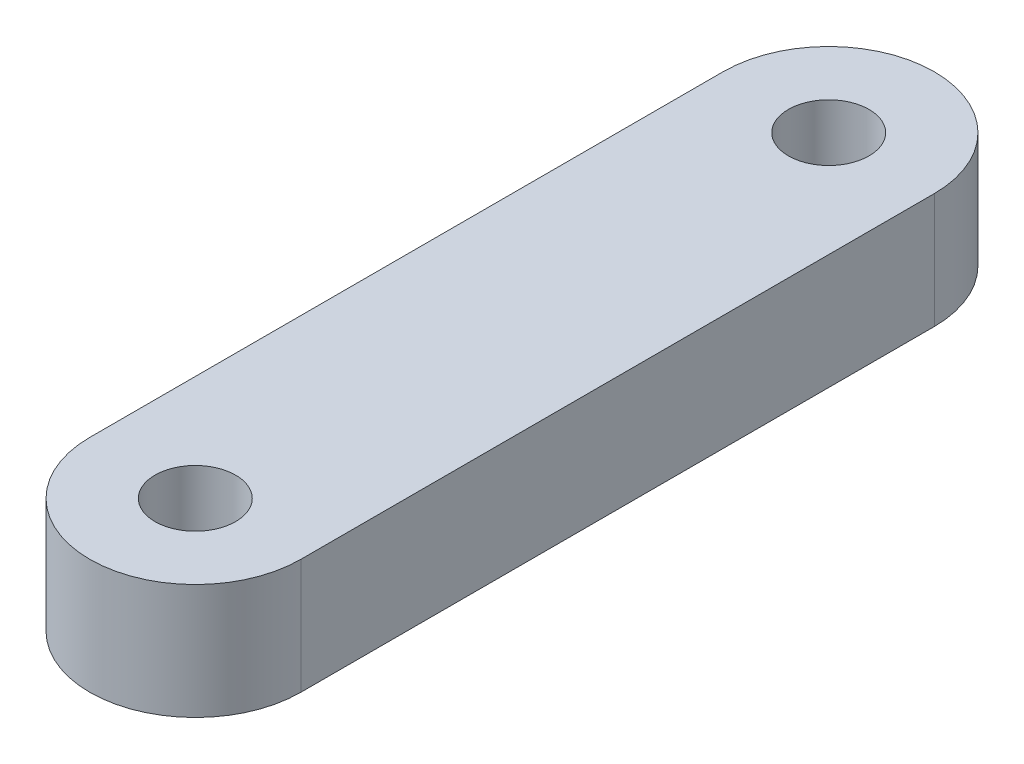
ISO-10303-21;
HEADER;
FILE_DESCRIPTION(('STEP AP214'),'2;1');
FILE_NAME('part.step','',(''),(''),'','','');
FILE_SCHEMA(('AUTOMOTIVE_DESIGN { 1 0 10303 214 1 1 1 1 }'));
ENDSEC;
DATA;
#1=APPLICATION_CONTEXT('core data for automotive mechanical design processes');
#2=APPLICATION_PROTOCOL_DEFINITION('international standard','automotive_design',2000,#1);
#3=PRODUCT_CONTEXT('',#1,'mechanical');
#4=PRODUCT('Part','Part','',(#3));
#5=PRODUCT_RELATED_PRODUCT_CATEGORY('part','',(#4));
#6=PRODUCT_DEFINITION_FORMATION('','',#4);
#7=PRODUCT_DEFINITION_CONTEXT('part definition',#1,'design');
#8=PRODUCT_DEFINITION('design','',#6,#7);
#9=PRODUCT_DEFINITION_SHAPE('','',#8);
#10=(LENGTH_UNIT() NAMED_UNIT(*) SI_UNIT(.MILLI.,.METRE.));
#11=(NAMED_UNIT(*) PLANE_ANGLE_UNIT() SI_UNIT($,.RADIAN.));
#12=(NAMED_UNIT(*) SI_UNIT($,.STERADIAN.) SOLID_ANGLE_UNIT());
#13=UNCERTAINTY_MEASURE_WITH_UNIT(LENGTH_MEASURE(1.E-05),#10,'distance_accuracy_value','');
#14=(GEOMETRIC_REPRESENTATION_CONTEXT(3) GLOBAL_UNCERTAINTY_ASSIGNED_CONTEXT((#13)) GLOBAL_UNIT_ASSIGNED_CONTEXT((#10,
#11,#12)) REPRESENTATION_CONTEXT('',''));
#15=CARTESIAN_POINT('',(0.,0.,0.));
#16=DIRECTION('',(0.,0.,1.));
#17=DIRECTION('',(1.,0.,0.));
#18=AXIS2_PLACEMENT_3D('',#15,#16,#17);
#19=CARTESIAN_POINT('',(-3.74636256248095,6.,-17.7239201973275));
#20=DIRECTION('',(0.,-1.,0.));
#21=DIRECTION('',(0.,0.,-1.));
#22=AXIS2_PLACEMENT_3D('',#19,#20,#21);
#23=PLANE('',#22);
#24=CARTESIAN_POINT('',(-3.74636256248095,6.,15.2760798026725));
#25=DIRECTION('',(0.,1.,0.));
#26=DIRECTION('',(0.,0.,1.));
#27=AXIS2_PLACEMENT_3D('',#24,#25,#26);
#28=CIRCLE('',#27,2.1);
#29=CARTESIAN_POINT('',(-3.74636256248095,6.,17.3760798026725));
#30=VERTEX_POINT('',#29);
#31=EDGE_CURVE('E99',#30,#30,#28,.T.);
#32=ORIENTED_EDGE('',*,*,#31,.F.);
#33=EDGE_LOOP('',(#32));
#34=FACE_BOUND('',#33,.T.);
#35=CARTESIAN_POINT('',(-3.74636256248095,6.,-17.7239201973275));
#36=DIRECTION('',(0.,1.,0.));
#37=DIRECTION('',(0.,0.,-1.));
#38=AXIS2_PLACEMENT_3D('',#35,#36,#37);
#39=CIRCLE('',#38,5.5);
#40=CARTESIAN_POINT('',(1.75363743751905,6.,-17.7239201973275));
#41=VERTEX_POINT('',#40);
#42=CARTESIAN_POINT('',(-9.24636256248095,6.,-17.7239201973275));
#43=VERTEX_POINT('',#42);
#44=EDGE_CURVE('E84',#41,#43,#39,.T.);
#45=ORIENTED_EDGE('',*,*,#44,.T.);
#46=DIRECTION('',(0.,0.,1.));
#47=VECTOR('',#46,1.);
#48=CARTESIAN_POINT('',(-9.24636256248095,6.,15.2760798026725));
#49=LINE('',#48,#47);
#50=CARTESIAN_POINT('',(-9.24636256248095,6.,15.2760798026725));
#51=VERTEX_POINT('',#50);
#52=EDGE_CURVE('E79',#43,#51,#49,.T.);
#53=ORIENTED_EDGE('',*,*,#52,.T.);
#54=CARTESIAN_POINT('',(-3.74636256248095,6.,15.2760798026725));
#55=DIRECTION('',(0.,1.,0.));
#56=DIRECTION('',(0.,0.,1.));
#57=AXIS2_PLACEMENT_3D('',#54,#55,#56);
#58=CIRCLE('',#57,5.5);
#59=CARTESIAN_POINT('',(1.75363743751905,6.,15.2760798026725));
#60=VERTEX_POINT('',#59);
#61=EDGE_CURVE('E82',#51,#60,#58,.T.);
#62=ORIENTED_EDGE('',*,*,#61,.T.);
#63=DIRECTION('',(0.,0.,-1.));
#64=VECTOR('',#63,1.);
#65=CARTESIAN_POINT('',(1.75363743751905,6.,-17.7239201973275));
#66=LINE('',#65,#64);
#67=EDGE_CURVE('E49',#60,#41,#66,.T.);
#68=ORIENTED_EDGE('',*,*,#67,.T.);
#69=EDGE_LOOP('',(#45,#53,#62,#68));
#70=FACE_BOUND('',#69,.T.);
#71=CARTESIAN_POINT('',(-3.74636256248095,6.,-17.7239201973275));
#72=DIRECTION('',(0.,1.,0.));
#73=DIRECTION('',(0.,0.,1.));
#74=AXIS2_PLACEMENT_3D('',#71,#72,#73);
#75=CIRCLE('',#74,2.10000000000508);
#76=CARTESIAN_POINT('',(-3.74636256248095,6.,-15.6239201973224));
#77=VERTEX_POINT('',#76);
#78=EDGE_CURVE('E114',#77,#77,#75,.T.);
#79=ORIENTED_EDGE('',*,*,#78,.F.);
#80=EDGE_LOOP('',(#79));
#81=FACE_BOUND('',#80,.T.);
#82=ADVANCED_FACE('F32',(#34,#70,#81),#23,.F.);
#83=CARTESIAN_POINT('',(-3.74636256248095,0.,-17.7239201973275));
#84=DIRECTION('',(0.,-1.,0.));
#85=DIRECTION('',(0.,0.,-1.));
#86=AXIS2_PLACEMENT_3D('',#83,#84,#85);
#87=PLANE('',#86);
#88=CARTESIAN_POINT('',(-3.74636256248095,0.,15.2760798026725));
#89=DIRECTION('',(0.,1.,0.));
#90=DIRECTION('',(0.,0.,1.));
#91=AXIS2_PLACEMENT_3D('',#88,#89,#90);
#92=CIRCLE('',#91,2.1);
#93=CARTESIAN_POINT('',(-3.74636256248095,0.,17.3760798026725));
#94=VERTEX_POINT('',#93);
#95=EDGE_CURVE('E111',#94,#94,#92,.T.);
#96=ORIENTED_EDGE('',*,*,#95,.T.);
#97=EDGE_LOOP('',(#96));
#98=FACE_BOUND('',#97,.T.);
#99=CARTESIAN_POINT('',(-3.74636256248095,0.,-17.7239201973275));
#100=DIRECTION('',(0.,1.,0.));
#101=DIRECTION('',(0.,0.,-1.));
#102=AXIS2_PLACEMENT_3D('',#99,#100,#101);
#103=CIRCLE('',#102,5.5);
#104=CARTESIAN_POINT('',(1.75363743751905,0.,-17.7239201973275));
#105=VERTEX_POINT('',#104);
#106=CARTESIAN_POINT('',(-9.24636256248095,0.,-17.7239201973275));
#107=VERTEX_POINT('',#106);
#108=EDGE_CURVE('E96',#105,#107,#103,.T.);
#109=ORIENTED_EDGE('',*,*,#108,.F.);
#110=DIRECTION('',(0.,0.,-1.));
#111=VECTOR('',#110,1.);
#112=CARTESIAN_POINT('',(1.75363743751905,0.,-17.7239201973275));
#113=LINE('',#112,#111);
#114=CARTESIAN_POINT('',(1.75363743751905,0.,15.2760798026725));
#115=VERTEX_POINT('',#114);
#116=EDGE_CURVE('E72',#115,#105,#113,.T.);
#117=ORIENTED_EDGE('',*,*,#116,.F.);
#118=CARTESIAN_POINT('',(-3.74636256248095,0.,15.2760798026725));
#119=DIRECTION('',(0.,1.,0.));
#120=DIRECTION('',(0.,0.,1.));
#121=AXIS2_PLACEMENT_3D('',#118,#119,#120);
#122=CIRCLE('',#121,5.5);
#123=CARTESIAN_POINT('',(-9.24636256248095,0.,15.2760798026725));
#124=VERTEX_POINT('',#123);
#125=EDGE_CURVE('E66',#124,#115,#122,.T.);
#126=ORIENTED_EDGE('',*,*,#125,.F.);
#127=DIRECTION('',(0.,0.,1.));
#128=VECTOR('',#127,1.);
#129=CARTESIAN_POINT('',(-9.24636256248095,0.,15.2760798026725));
#130=LINE('',#129,#128);
#131=EDGE_CURVE('E88',#107,#124,#130,.T.);
#132=ORIENTED_EDGE('',*,*,#131,.F.);
#133=EDGE_LOOP('',(#109,#117,#126,#132));
#134=FACE_BOUND('',#133,.T.);
#135=CARTESIAN_POINT('',(-3.74636256248095,0.,-17.7239201973275));
#136=DIRECTION('',(0.,1.,0.));
#137=DIRECTION('',(0.,0.,1.));
#138=AXIS2_PLACEMENT_3D('',#135,#136,#137);
#139=CIRCLE('',#138,2.10000000000508);
#140=CARTESIAN_POINT('',(-3.74636256248095,0.,-15.6239201973224));
#141=VERTEX_POINT('',#140);
#142=EDGE_CURVE('E117',#141,#141,#139,.T.);
#143=ORIENTED_EDGE('',*,*,#142,.T.);
#144=EDGE_LOOP('',(#143));
#145=FACE_BOUND('',#144,.T.);
#146=ADVANCED_FACE('F107',(#98,#134,#145),#87,.T.);
#147=CARTESIAN_POINT('',(-3.74636256248095,6.,-17.7239201973275));
#148=DIRECTION('',(0.,-1.,0.));
#149=DIRECTION('',(0.,0.,-1.));
#150=AXIS2_PLACEMENT_3D('',#147,#148,#149);
#151=CYLINDRICAL_SURFACE('',#150,5.5);
#152=ORIENTED_EDGE('',*,*,#108,.T.);
#153=DIRECTION('',(0.,-1.,0.));
#154=VECTOR('',#153,1.);
#155=CARTESIAN_POINT('',(-9.24636256248095,6.,-17.7239201973275));
#156=LINE('',#155,#154);
#157=EDGE_CURVE('E11',#43,#107,#156,.T.);
#158=ORIENTED_EDGE('',*,*,#157,.F.);
#159=ORIENTED_EDGE('',*,*,#44,.F.);
#160=DIRECTION('',(0.,-1.,0.));
#161=VECTOR('',#160,1.);
#162=CARTESIAN_POINT('',(1.75363743751905,6.,-17.7239201973275));
#163=LINE('',#162,#161);
#164=EDGE_CURVE('E92',#41,#105,#163,.T.);
#165=ORIENTED_EDGE('',*,*,#164,.T.);
#166=EDGE_LOOP('',(#152,#158,#159,#165));
#167=FACE_BOUND('',#166,.T.);
#168=ADVANCED_FACE('F34',(#167),#151,.T.);
#169=CARTESIAN_POINT('',(-9.24636256248095,6.,15.2760798026725));
#170=DIRECTION('',(1.,0.,0.));
#171=DIRECTION('',(0.,0.,-1.));
#172=AXIS2_PLACEMENT_3D('',#169,#170,#171);
#173=PLANE('',#172);
#174=ORIENTED_EDGE('',*,*,#131,.T.);
#175=DIRECTION('',(0.,-1.,0.));
#176=VECTOR('',#175,1.);
#177=CARTESIAN_POINT('',(-9.24636256248095,6.,15.2760798026725));
#178=LINE('',#177,#176);
#179=EDGE_CURVE('E41',#51,#124,#178,.T.);
#180=ORIENTED_EDGE('',*,*,#179,.F.);
#181=ORIENTED_EDGE('',*,*,#52,.F.);
#182=ORIENTED_EDGE('',*,*,#157,.T.);
#183=EDGE_LOOP('',(#174,#180,#181,#182));
#184=FACE_BOUND('',#183,.T.);
#185=ADVANCED_FACE('F87',(#184),#173,.F.);
#186=CARTESIAN_POINT('',(-3.74636256248095,6.,15.2760798026725));
#187=DIRECTION('',(0.,-1.,0.));
#188=DIRECTION('',(0.,0.,-1.));
#189=AXIS2_PLACEMENT_3D('',#186,#187,#188);
#190=CYLINDRICAL_SURFACE('',#189,5.5);
#191=ORIENTED_EDGE('',*,*,#125,.T.);
#192=DIRECTION('',(0.,-1.,0.));
#193=VECTOR('',#192,1.);
#194=CARTESIAN_POINT('',(1.75363743751905,6.,15.2760798026725));
#195=LINE('',#194,#193);
#196=EDGE_CURVE('E89',#60,#115,#195,.T.);
#197=ORIENTED_EDGE('',*,*,#196,.F.);
#198=ORIENTED_EDGE('',*,*,#61,.F.);
#199=ORIENTED_EDGE('',*,*,#179,.T.);
#200=EDGE_LOOP('',(#191,#197,#198,#199));
#201=FACE_BOUND('',#200,.T.);
#202=ADVANCED_FACE('F90',(#201),#190,.T.);
#203=CARTESIAN_POINT('',(1.75363743751905,6.,-17.7239201973275));
#204=DIRECTION('',(-1.,0.,0.));
#205=DIRECTION('',(0.,0.,1.));
#206=AXIS2_PLACEMENT_3D('',#203,#204,#205);
#207=PLANE('',#206);
#208=ORIENTED_EDGE('',*,*,#116,.T.);
#209=ORIENTED_EDGE('',*,*,#164,.F.);
#210=ORIENTED_EDGE('',*,*,#67,.F.);
#211=ORIENTED_EDGE('',*,*,#196,.T.);
#212=EDGE_LOOP('',(#208,#209,#210,#211));
#213=FACE_BOUND('',#212,.T.);
#214=ADVANCED_FACE('F104',(#213),#207,.F.);
#215=CARTESIAN_POINT('',(-3.74636256248095,6.,15.2760798026725));
#216=DIRECTION('',(0.,-1.,0.));
#217=DIRECTION('',(0.,0.,-1.));
#218=AXIS2_PLACEMENT_3D('',#215,#216,#217);
#219=CYLINDRICAL_SURFACE('',#218,2.1);
#220=ORIENTED_EDGE('',*,*,#31,.T.);
#221=EDGE_LOOP('',(#220));
#222=FACE_BOUND('',#221,.T.);
#223=ORIENTED_EDGE('',*,*,#95,.F.);
#224=EDGE_LOOP('',(#223));
#225=FACE_BOUND('',#224,.T.);
#226=ADVANCED_FACE('F135',(#222,#225),#219,.F.);
#227=CARTESIAN_POINT('',(-3.74636256248095,6.,-17.7239201973275));
#228=DIRECTION('',(0.,-1.,0.));
#229=DIRECTION('',(0.,0.,-1.));
#230=AXIS2_PLACEMENT_3D('',#227,#228,#229);
#231=CYLINDRICAL_SURFACE('',#230,2.10000000000508);
#232=ORIENTED_EDGE('',*,*,#78,.T.);
#233=EDGE_LOOP('',(#232));
#234=FACE_BOUND('',#233,.T.);
#235=ORIENTED_EDGE('',*,*,#142,.F.);
#236=EDGE_LOOP('',(#235));
#237=FACE_BOUND('',#236,.T.);
#238=ADVANCED_FACE('F123',(#234,#237),#231,.F.);
#239=CLOSED_SHELL('',(#82,#146,#168,#185,#202,#214,#226,#238));
#240=MANIFOLD_SOLID_BREP('B2',#239);
#241=ADVANCED_BREP_SHAPE_REPRESENTATION('',(#18,#240),#14);
#242=SHAPE_DEFINITION_REPRESENTATION(#9,#241);
ENDSEC;
END-ISO-10303-21;
